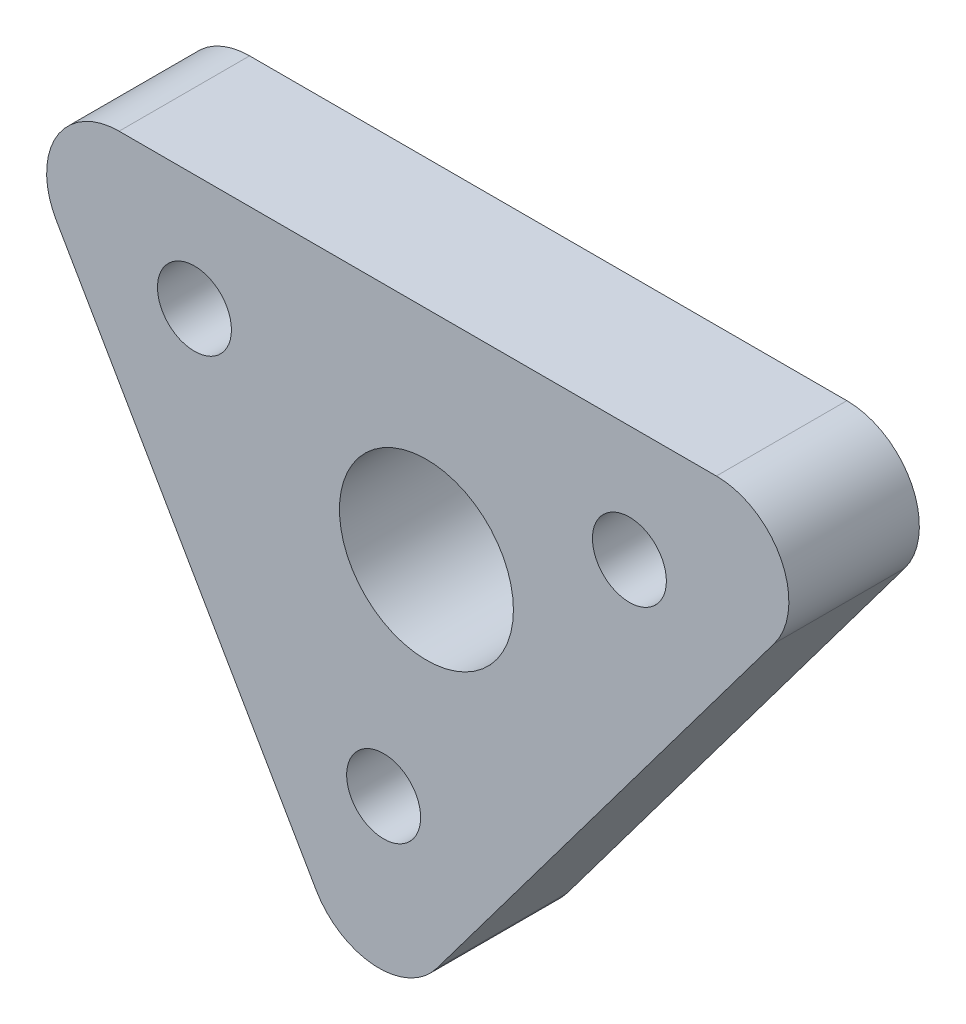
ISO-10303-21;
HEADER;
FILE_DESCRIPTION(('STEP AP214'),'2;1');
FILE_NAME('part.step','',(''),(''),'','','');
FILE_SCHEMA(('AUTOMOTIVE_DESIGN { 1 0 10303 214 1 1 1 1 }'));
ENDSEC;
DATA;
#1=APPLICATION_CONTEXT('core data for automotive mechanical design processes');
#2=APPLICATION_PROTOCOL_DEFINITION('international standard','automotive_design',2000,#1);
#3=PRODUCT_CONTEXT('',#1,'mechanical');
#4=PRODUCT('Part','Part','',(#3));
#5=PRODUCT_RELATED_PRODUCT_CATEGORY('part','',(#4));
#6=PRODUCT_DEFINITION_FORMATION('','',#4);
#7=PRODUCT_DEFINITION_CONTEXT('part definition',#1,'design');
#8=PRODUCT_DEFINITION('design','',#6,#7);
#9=PRODUCT_DEFINITION_SHAPE('','',#8);
#10=(LENGTH_UNIT() NAMED_UNIT(*) SI_UNIT(.MILLI.,.METRE.));
#11=(NAMED_UNIT(*) PLANE_ANGLE_UNIT() SI_UNIT($,.RADIAN.));
#12=(NAMED_UNIT(*) SI_UNIT($,.STERADIAN.) SOLID_ANGLE_UNIT());
#13=UNCERTAINTY_MEASURE_WITH_UNIT(LENGTH_MEASURE(1.E-05),#10,'distance_accuracy_value','');
#14=(GEOMETRIC_REPRESENTATION_CONTEXT(3) GLOBAL_UNCERTAINTY_ASSIGNED_CONTEXT((#13)) GLOBAL_UNIT_ASSIGNED_CONTEXT((#10,
#11,#12)) REPRESENTATION_CONTEXT('',''));
#15=CARTESIAN_POINT('',(0.,0.,0.));
#16=DIRECTION('',(0.,0.,1.));
#17=DIRECTION('',(1.,0.,0.));
#18=AXIS2_PLACEMENT_3D('',#15,#16,#17);
#19=CARTESIAN_POINT('',(0.,0.,9.));
#20=DIRECTION('',(0.,0.,1.));
#21=DIRECTION('',(1.,0.,0.));
#22=AXIS2_PLACEMENT_3D('',#19,#20,#21);
#23=PLANE('',#22);
#24=CARTESIAN_POINT('',(-10.1970443349741,19.3205148577792,9.));
#25=DIRECTION('',(0.,0.,1.));
#26=DIRECTION('',(1.,0.,0.));
#27=AXIS2_PLACEMENT_3D('',#24,#25,#26);
#28=CIRCLE('',#27,2.55);
#29=CARTESIAN_POINT('',(-7.64704433497411,19.3205148577792,9.));
#30=VERTEX_POINT('',#29);
#31=EDGE_CURVE('E269',#30,#30,#28,.T.);
#32=ORIENTED_EDGE('',*,*,#31,.F.);
#33=EDGE_LOOP('',(#32));
#34=FACE_BOUND('',#33,.T.);
#35=CARTESIAN_POINT('',(-27.148108814538,-3.28090444830602,9.));
#36=DIRECTION('',(0.,0.,1.));
#37=DIRECTION('',(1.,0.,0.));
#38=AXIS2_PLACEMENT_3D('',#35,#36,#37);
#39=CIRCLE('',#38,2.55);
#40=CARTESIAN_POINT('',(-24.598108814538,-3.28090444830602,9.));
#41=VERTEX_POINT('',#40);
#42=EDGE_CURVE('E120',#41,#41,#39,.T.);
#43=ORIENTED_EDGE('',*,*,#42,.F.);
#44=EDGE_LOOP('',(#43));
#45=FACE_BOUND('',#44,.T.);
#46=DIRECTION('',(0.500000000000004,-0.866025403784436,0.));
#47=VECTOR('',#46,1.);
#48=CARTESIAN_POINT('',(-28.0180378492337,-17.7741431612336,9.));
#49=LINE('',#48,#47);
#50=CARTESIAN_POINT('',(-49.7233237766029,19.8205148577792,9.));
#51=VERTEX_POINT('',#50);
#52=CARTESIAN_POINT('',(-31.8044592214711,-11.2158689656539,9.));
#53=VERTEX_POINT('',#52);
#54=EDGE_CURVE('E118',#51,#53,#49,.T.);
#55=ORIENTED_EDGE('',*,*,#54,.T.);
#56=CARTESIAN_POINT('',(-27.4743322025489,-8.71586896565388,9.));
#57=DIRECTION('',(0.,0.,1.));
#58=DIRECTION('',(1.,0.,0.));
#59=AXIS2_PLACEMENT_3D('',#56,#57,#58);
#60=CIRCLE('',#59,5.);
#61=CARTESIAN_POINT('',(-23.4743322025489,-11.7158689656539,9.));
#62=VERTEX_POINT('',#61);
#63=EDGE_CURVE('E134',#53,#62,#60,.T.);
#64=ORIENTED_EDGE('',*,*,#63,.T.);
#65=DIRECTION('',(0.6,0.8,0.));
#66=VECTOR('',#65,1.);
#67=CARTESIAN_POINT('',(5.80295566502587,27.3205148577792,9.));
#68=LINE('',#67,#66);
#69=CARTESIAN_POINT('',(-0.197044334974119,19.3205148577792,9.));
#70=VERTEX_POINT('',#69);
#71=EDGE_CURVE('E108',#62,#70,#68,.T.);
#72=ORIENTED_EDGE('',*,*,#71,.T.);
#73=CARTESIAN_POINT('',(-4.19704433497412,22.3205148577792,9.));
#74=DIRECTION('',(0.,0.,1.));
#75=DIRECTION('',(1.,0.,0.));
#76=AXIS2_PLACEMENT_3D('',#73,#74,#75);
#77=CIRCLE('',#76,5.);
#78=CARTESIAN_POINT('',(-4.19704433497412,27.3205148577792,9.));
#79=VERTEX_POINT('',#78);
#80=EDGE_CURVE('E56',#70,#79,#77,.T.);
#81=ORIENTED_EDGE('',*,*,#80,.T.);
#82=DIRECTION('',(-1.,0.,0.));
#83=VECTOR('',#82,1.);
#84=CARTESIAN_POINT('',(-54.0534507955252,27.3205148577792,9.));
#85=LINE('',#84,#83);
#86=CARTESIAN_POINT('',(-45.3931967576808,27.3205148577792,9.));
#87=VERTEX_POINT('',#86);
#88=EDGE_CURVE('E124',#79,#87,#85,.T.);
#89=ORIENTED_EDGE('',*,*,#88,.T.);
#90=CARTESIAN_POINT('',(-45.3931967576808,22.3205148577792,9.));
#91=DIRECTION('',(0.,0.,1.));
#92=DIRECTION('',(1.,0.,0.));
#93=AXIS2_PLACEMENT_3D('',#90,#91,#92);
#94=CIRCLE('',#93,5.);
#95=EDGE_CURVE('E131',#87,#51,#94,.T.);
#96=ORIENTED_EDGE('',*,*,#95,.T.);
#97=EDGE_LOOP('',(#55,#64,#72,#81,#89,#96));
#98=FACE_BOUND('',#97,.T.);
#99=CARTESIAN_POINT('',(-40.1970443349741,19.3205148577792,9.));
#100=DIRECTION('',(0.,0.,1.));
#101=DIRECTION('',(1.,0.,0.));
#102=AXIS2_PLACEMENT_3D('',#99,#100,#101);
#103=CIRCLE('',#102,2.55);
#104=CARTESIAN_POINT('',(-37.6470443349741,19.3205148577792,9.));
#105=VERTEX_POINT('',#104);
#106=EDGE_CURVE('E275',#105,#105,#103,.T.);
#107=ORIENTED_EDGE('',*,*,#106,.F.);
#108=EDGE_LOOP('',(#107));
#109=FACE_BOUND('',#108,.T.);
#110=CARTESIAN_POINT('',(-24.1970443349741,12.3205148577792,9.));
#111=DIRECTION('',(0.,0.,1.));
#112=DIRECTION('',(1.,0.,0.));
#113=AXIS2_PLACEMENT_3D('',#110,#111,#112);
#114=CIRCLE('',#113,6.);
#115=CARTESIAN_POINT('',(-18.1970443349741,12.3205148577792,9.));
#116=VERTEX_POINT('',#115);
#117=EDGE_CURVE('E260',#116,#116,#114,.T.);
#118=ORIENTED_EDGE('',*,*,#117,.F.);
#119=EDGE_LOOP('',(#118));
#120=FACE_BOUND('',#119,.T.);
#121=ADVANCED_FACE('F35',(#34,#45,#98,#109,#120),#23,.T.);
#122=CARTESIAN_POINT('',(0.,0.,0.));
#123=DIRECTION('',(0.,0.,1.));
#124=DIRECTION('',(1.,0.,0.));
#125=AXIS2_PLACEMENT_3D('',#122,#123,#124);
#126=PLANE('',#125);
#127=DIRECTION('',(0.6,0.8,0.));
#128=VECTOR('',#127,1.);
#129=CARTESIAN_POINT('',(5.80295566502587,27.3205148577792,0.));
#130=LINE('',#129,#128);
#131=CARTESIAN_POINT('',(-23.4743322025489,-11.7158689656539,0.));
#132=VERTEX_POINT('',#131);
#133=CARTESIAN_POINT('',(-0.197044334974119,19.3205148577792,0.));
#134=VERTEX_POINT('',#133);
#135=EDGE_CURVE('E106',#132,#134,#130,.T.);
#136=ORIENTED_EDGE('',*,*,#135,.F.);
#137=CARTESIAN_POINT('',(-27.4743322025489,-8.71586896565388,0.));
#138=DIRECTION('',(0.,0.,1.));
#139=DIRECTION('',(1.,0.,0.));
#140=AXIS2_PLACEMENT_3D('',#137,#138,#139);
#141=CIRCLE('',#140,5.);
#142=CARTESIAN_POINT('',(-31.8044592214711,-11.2158689656539,0.));
#143=VERTEX_POINT('',#142);
#144=EDGE_CURVE('E89',#132,#143,#141,.F.);
#145=ORIENTED_EDGE('',*,*,#144,.T.);
#146=DIRECTION('',(0.500000000000004,-0.866025403784436,0.));
#147=VECTOR('',#146,1.);
#148=CARTESIAN_POINT('',(-28.0180378492337,-17.7741431612336,0.));
#149=LINE('',#148,#147);
#150=CARTESIAN_POINT('',(-49.7233237766029,19.8205148577792,0.));
#151=VERTEX_POINT('',#150);
#152=EDGE_CURVE('E116',#151,#143,#149,.T.);
#153=ORIENTED_EDGE('',*,*,#152,.F.);
#154=CARTESIAN_POINT('',(-45.3931967576808,22.3205148577792,0.));
#155=DIRECTION('',(0.,0.,1.));
#156=DIRECTION('',(1.,0.,0.));
#157=AXIS2_PLACEMENT_3D('',#154,#155,#156);
#158=CIRCLE('',#157,5.);
#159=CARTESIAN_POINT('',(-45.3931967576808,27.3205148577792,0.));
#160=VERTEX_POINT('',#159);
#161=EDGE_CURVE('E109',#151,#160,#158,.F.);
#162=ORIENTED_EDGE('',*,*,#161,.T.);
#163=DIRECTION('',(-1.,0.,0.));
#164=VECTOR('',#163,1.);
#165=CARTESIAN_POINT('',(-54.0534507955252,27.3205148577792,0.));
#166=LINE('',#165,#164);
#167=CARTESIAN_POINT('',(-4.19704433497412,27.3205148577792,0.));
#168=VERTEX_POINT('',#167);
#169=EDGE_CURVE('E115',#168,#160,#166,.T.);
#170=ORIENTED_EDGE('',*,*,#169,.F.);
#171=CARTESIAN_POINT('',(-4.19704433497412,22.3205148577792,0.));
#172=DIRECTION('',(0.,0.,1.));
#173=DIRECTION('',(1.,0.,0.));
#174=AXIS2_PLACEMENT_3D('',#171,#172,#173);
#175=CIRCLE('',#174,5.);
#176=EDGE_CURVE('E100',#168,#134,#175,.F.);
#177=ORIENTED_EDGE('',*,*,#176,.T.);
#178=EDGE_LOOP('',(#136,#145,#153,#162,#170,#177));
#179=FACE_BOUND('',#178,.T.);
#180=CARTESIAN_POINT('',(-27.148108814538,-3.28090444830602,0.));
#181=DIRECTION('',(0.,0.,1.));
#182=DIRECTION('',(1.,0.,0.));
#183=AXIS2_PLACEMENT_3D('',#180,#181,#182);
#184=CIRCLE('',#183,2.55);
#185=CARTESIAN_POINT('',(-24.598108814538,-3.28090444830602,0.));
#186=VERTEX_POINT('',#185);
#187=EDGE_CURVE('E144',#186,#186,#184,.T.);
#188=ORIENTED_EDGE('',*,*,#187,.T.);
#189=EDGE_LOOP('',(#188));
#190=FACE_BOUND('',#189,.T.);
#191=CARTESIAN_POINT('',(-40.1970443349741,19.3205148577792,0.));
#192=DIRECTION('',(0.,0.,1.));
#193=DIRECTION('',(1.,0.,0.));
#194=AXIS2_PLACEMENT_3D('',#191,#192,#193);
#195=CIRCLE('',#194,2.55);
#196=CARTESIAN_POINT('',(-37.6470443349741,19.3205148577792,0.));
#197=VERTEX_POINT('',#196);
#198=EDGE_CURVE('E272',#197,#197,#195,.T.);
#199=ORIENTED_EDGE('',*,*,#198,.T.);
#200=EDGE_LOOP('',(#199));
#201=FACE_BOUND('',#200,.T.);
#202=CARTESIAN_POINT('',(-10.1970443349741,19.3205148577792,0.));
#203=DIRECTION('',(0.,0.,1.));
#204=DIRECTION('',(1.,0.,0.));
#205=AXIS2_PLACEMENT_3D('',#202,#203,#204);
#206=CIRCLE('',#205,2.55);
#207=CARTESIAN_POINT('',(-7.64704433497411,19.3205148577792,0.));
#208=VERTEX_POINT('',#207);
#209=EDGE_CURVE('E266',#208,#208,#206,.T.);
#210=ORIENTED_EDGE('',*,*,#209,.T.);
#211=EDGE_LOOP('',(#210));
#212=FACE_BOUND('',#211,.T.);
#213=CARTESIAN_POINT('',(-24.1970443349741,12.3205148577792,0.));
#214=DIRECTION('',(0.,0.,1.));
#215=DIRECTION('',(1.,0.,0.));
#216=AXIS2_PLACEMENT_3D('',#213,#214,#215);
#217=CIRCLE('',#216,6.);
#218=CARTESIAN_POINT('',(-18.1970443349741,12.3205148577792,0.));
#219=VERTEX_POINT('',#218);
#220=EDGE_CURVE('E263',#219,#219,#217,.T.);
#221=ORIENTED_EDGE('',*,*,#220,.T.);
#222=EDGE_LOOP('',(#221));
#223=FACE_BOUND('',#222,.T.);
#224=ADVANCED_FACE('F112',(#179,#190,#201,#212,#223),#126,.F.);
#225=CARTESIAN_POINT('',(-28.0180378492337,-17.7741431612336,9.));
#226=DIRECTION('',(0.866025403784436,0.500000000000004,0.));
#227=DIRECTION('',(-0.500000000000004,0.866025403784436,0.));
#228=AXIS2_PLACEMENT_3D('',#225,#226,#227);
#229=PLANE('',#228);
#230=ORIENTED_EDGE('',*,*,#152,.T.);
#231=DIRECTION('',(0.,0.,-1.));
#232=VECTOR('',#231,1.);
#233=CARTESIAN_POINT('',(-31.8044592214711,-11.2158689656539,9.));
#234=LINE('',#233,#232);
#235=EDGE_CURVE('E94',#143,#53,#234,.F.);
#236=ORIENTED_EDGE('',*,*,#235,.T.);
#237=ORIENTED_EDGE('',*,*,#54,.F.);
#238=DIRECTION('',(0.,0.,-1.));
#239=VECTOR('',#238,1.);
#240=CARTESIAN_POINT('',(-49.723323776603,19.8205148577792,9.));
#241=LINE('',#240,#239);
#242=EDGE_CURVE('E99',#51,#151,#241,.T.);
#243=ORIENTED_EDGE('',*,*,#242,.T.);
#244=EDGE_LOOP('',(#230,#236,#237,#243));
#245=FACE_BOUND('',#244,.T.);
#246=ADVANCED_FACE('F148',(#245),#229,.F.);
#247=CARTESIAN_POINT('',(5.80295566502587,27.3205148577792,9.));
#248=DIRECTION('',(-0.8,0.599999999999999,0.));
#249=DIRECTION('',(-0.6,-0.800000000000001,0.));
#250=AXIS2_PLACEMENT_3D('',#247,#248,#249);
#251=PLANE('',#250);
#252=ORIENTED_EDGE('',*,*,#71,.F.);
#253=DIRECTION('',(0.,0.,-1.));
#254=VECTOR('',#253,1.);
#255=CARTESIAN_POINT('',(-23.4743322025489,-11.7158689656539,9.));
#256=LINE('',#255,#254);
#257=EDGE_CURVE('E93',#62,#132,#256,.T.);
#258=ORIENTED_EDGE('',*,*,#257,.T.);
#259=ORIENTED_EDGE('',*,*,#135,.T.);
#260=DIRECTION('',(0.,0.,-1.));
#261=VECTOR('',#260,1.);
#262=CARTESIAN_POINT('',(-0.197044334974118,19.3205148577792,9.));
#263=LINE('',#262,#261);
#264=EDGE_CURVE('E110',#134,#70,#263,.F.);
#265=ORIENTED_EDGE('',*,*,#264,.T.);
#266=EDGE_LOOP('',(#252,#258,#259,#265));
#267=FACE_BOUND('',#266,.T.);
#268=ADVANCED_FACE('F105',(#267),#251,.F.);
#269=CARTESIAN_POINT('',(-54.0534507955252,27.3205148577792,9.));
#270=DIRECTION('',(0.,-1.,0.));
#271=DIRECTION('',(0.,0.,-1.));
#272=AXIS2_PLACEMENT_3D('',#269,#270,#271);
#273=PLANE('',#272);
#274=ORIENTED_EDGE('',*,*,#88,.F.);
#275=DIRECTION('',(0.,0.,-1.));
#276=VECTOR('',#275,1.);
#277=CARTESIAN_POINT('',(-4.19704433497412,27.3205148577792,9.));
#278=LINE('',#277,#276);
#279=EDGE_CURVE('E11',#79,#168,#278,.T.);
#280=ORIENTED_EDGE('',*,*,#279,.T.);
#281=ORIENTED_EDGE('',*,*,#169,.T.);
#282=DIRECTION('',(0.,0.,-1.));
#283=VECTOR('',#282,1.);
#284=CARTESIAN_POINT('',(-45.3931967576808,27.3205148577792,9.));
#285=LINE('',#284,#283);
#286=EDGE_CURVE('E43',#160,#87,#285,.F.);
#287=ORIENTED_EDGE('',*,*,#286,.T.);
#288=EDGE_LOOP('',(#274,#280,#281,#287));
#289=FACE_BOUND('',#288,.T.);
#290=ADVANCED_FACE('F149',(#289),#273,.F.);
#291=CARTESIAN_POINT('',(-27.148108814538,-3.28090444830602,9.));
#292=DIRECTION('',(0.,0.,-1.));
#293=DIRECTION('',(-1.,0.,0.));
#294=AXIS2_PLACEMENT_3D('',#291,#292,#293);
#295=CYLINDRICAL_SURFACE('',#294,2.55);
#296=ORIENTED_EDGE('',*,*,#42,.T.);
#297=EDGE_LOOP('',(#296));
#298=FACE_BOUND('',#297,.T.);
#299=ORIENTED_EDGE('',*,*,#187,.F.);
#300=EDGE_LOOP('',(#299));
#301=FACE_BOUND('',#300,.T.);
#302=ADVANCED_FACE('F169',(#298,#301),#295,.F.);
#303=CARTESIAN_POINT('',(-40.1970443349741,19.3205148577792,9.));
#304=DIRECTION('',(0.,0.,-1.));
#305=DIRECTION('',(-1.,0.,0.));
#306=AXIS2_PLACEMENT_3D('',#303,#304,#305);
#307=CYLINDRICAL_SURFACE('',#306,2.55);
#308=ORIENTED_EDGE('',*,*,#106,.T.);
#309=EDGE_LOOP('',(#308));
#310=FACE_BOUND('',#309,.T.);
#311=ORIENTED_EDGE('',*,*,#198,.F.);
#312=EDGE_LOOP('',(#311));
#313=FACE_BOUND('',#312,.T.);
#314=ADVANCED_FACE('F196',(#310,#313),#307,.F.);
#315=CARTESIAN_POINT('',(-10.1970443349741,19.3205148577792,9.));
#316=DIRECTION('',(0.,0.,-1.));
#317=DIRECTION('',(-1.,0.,0.));
#318=AXIS2_PLACEMENT_3D('',#315,#316,#317);
#319=CYLINDRICAL_SURFACE('',#318,2.55);
#320=ORIENTED_EDGE('',*,*,#31,.T.);
#321=EDGE_LOOP('',(#320));
#322=FACE_BOUND('',#321,.T.);
#323=ORIENTED_EDGE('',*,*,#209,.F.);
#324=EDGE_LOOP('',(#323));
#325=FACE_BOUND('',#324,.T.);
#326=ADVANCED_FACE('F203',(#322,#325),#319,.F.);
#327=CARTESIAN_POINT('',(-24.1970443349741,12.3205148577792,9.));
#328=DIRECTION('',(0.,0.,-1.));
#329=DIRECTION('',(-1.,0.,0.));
#330=AXIS2_PLACEMENT_3D('',#327,#328,#329);
#331=CYLINDRICAL_SURFACE('',#330,6.);
#332=ORIENTED_EDGE('',*,*,#117,.T.);
#333=EDGE_LOOP('',(#332));
#334=FACE_BOUND('',#333,.T.);
#335=ORIENTED_EDGE('',*,*,#220,.F.);
#336=EDGE_LOOP('',(#335));
#337=FACE_BOUND('',#336,.T.);
#338=ADVANCED_FACE('F157',(#334,#337),#331,.F.);
#339=CARTESIAN_POINT('',(-27.4743322025489,-8.71586896565388,9.));
#340=DIRECTION('',(0.,0.,-1.));
#341=DIRECTION('',(-1.,0.,0.));
#342=AXIS2_PLACEMENT_3D('',#339,#340,#341);
#343=CYLINDRICAL_SURFACE('',#342,5.);
#344=ORIENTED_EDGE('',*,*,#63,.F.);
#345=ORIENTED_EDGE('',*,*,#235,.F.);
#346=ORIENTED_EDGE('',*,*,#144,.F.);
#347=ORIENTED_EDGE('',*,*,#257,.F.);
#348=EDGE_LOOP('',(#344,#345,#346,#347));
#349=FACE_BOUND('',#348,.T.);
#350=ADVANCED_FACE('F92',(#349),#343,.T.);
#351=CARTESIAN_POINT('',(-4.19704433497412,22.3205148577792,9.));
#352=DIRECTION('',(0.,0.,-1.));
#353=DIRECTION('',(-1.,0.,0.));
#354=AXIS2_PLACEMENT_3D('',#351,#352,#353);
#355=CYLINDRICAL_SURFACE('',#354,5.);
#356=ORIENTED_EDGE('',*,*,#80,.F.);
#357=ORIENTED_EDGE('',*,*,#264,.F.);
#358=ORIENTED_EDGE('',*,*,#176,.F.);
#359=ORIENTED_EDGE('',*,*,#279,.F.);
#360=EDGE_LOOP('',(#356,#357,#358,#359));
#361=FACE_BOUND('',#360,.T.);
#362=ADVANCED_FACE('F151',(#361),#355,.T.);
#363=CARTESIAN_POINT('',(-45.3931967576808,22.3205148577792,9.));
#364=DIRECTION('',(0.,0.,-1.));
#365=DIRECTION('',(-1.,0.,0.));
#366=AXIS2_PLACEMENT_3D('',#363,#364,#365);
#367=CYLINDRICAL_SURFACE('',#366,5.);
#368=ORIENTED_EDGE('',*,*,#95,.F.);
#369=ORIENTED_EDGE('',*,*,#286,.F.);
#370=ORIENTED_EDGE('',*,*,#161,.F.);
#371=ORIENTED_EDGE('',*,*,#242,.F.);
#372=EDGE_LOOP('',(#368,#369,#370,#371));
#373=FACE_BOUND('',#372,.T.);
#374=ADVANCED_FACE('F37',(#373),#367,.T.);
#375=CLOSED_SHELL('',(#121,#224,#246,#268,#290,#302,#314,#326,#338,#350,#362,#374));
#376=MANIFOLD_SOLID_BREP('B2',#375);
#377=ADVANCED_BREP_SHAPE_REPRESENTATION('',(#18,#376),#14);
#378=SHAPE_DEFINITION_REPRESENTATION(#9,#377);
ENDSEC;
END-ISO-10303-21;
